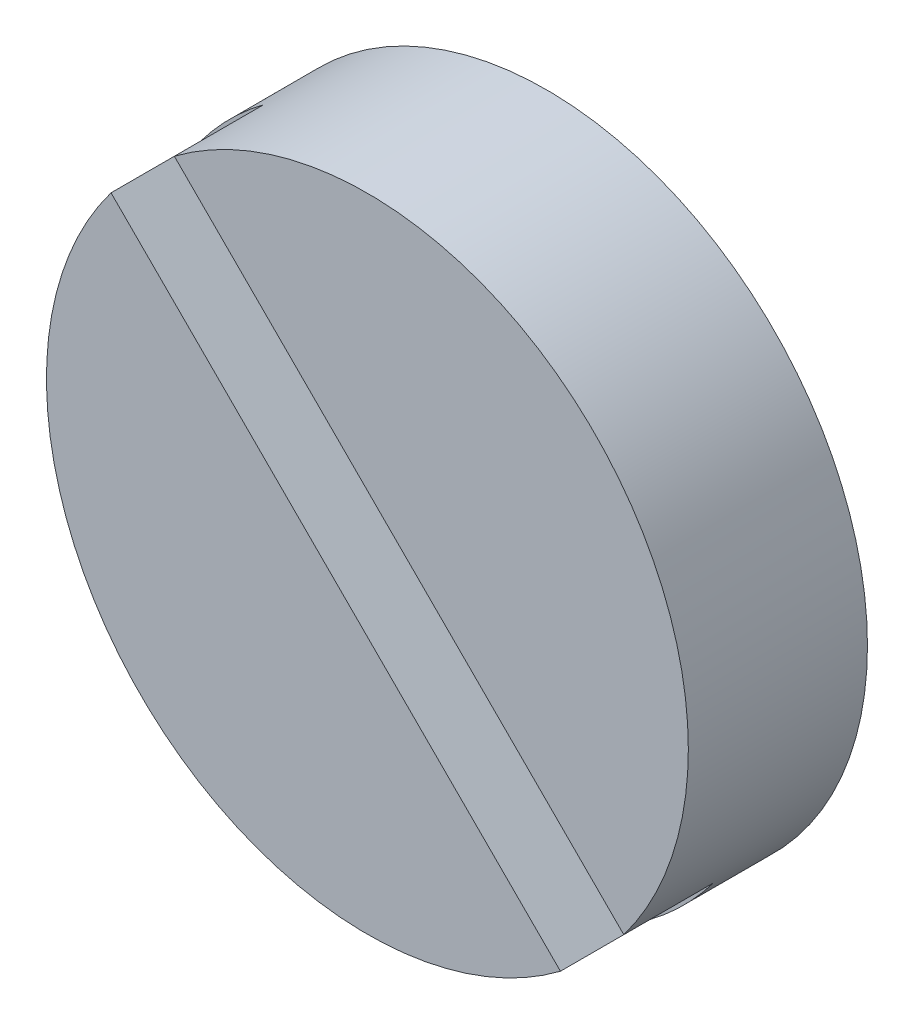
ISO-10303-21;
HEADER;
FILE_DESCRIPTION(('STEP AP214'),'2;1');
FILE_NAME('part.step','',(''),(''),'','','');
FILE_SCHEMA(('AUTOMOTIVE_DESIGN { 1 0 10303 214 1 1 1 1 }'));
ENDSEC;
DATA;
#1=APPLICATION_CONTEXT('core data for automotive mechanical design processes');
#2=APPLICATION_PROTOCOL_DEFINITION('international standard','automotive_design',2000,#1);
#3=PRODUCT_CONTEXT('',#1,'mechanical');
#4=PRODUCT('Part','Part','',(#3));
#5=PRODUCT_RELATED_PRODUCT_CATEGORY('part','',(#4));
#6=PRODUCT_DEFINITION_FORMATION('','',#4);
#7=PRODUCT_DEFINITION_CONTEXT('part definition',#1,'design');
#8=PRODUCT_DEFINITION('design','',#6,#7);
#9=PRODUCT_DEFINITION_SHAPE('','',#8);
#10=(LENGTH_UNIT() NAMED_UNIT(*) SI_UNIT(.MILLI.,.METRE.));
#11=(NAMED_UNIT(*) PLANE_ANGLE_UNIT() SI_UNIT($,.RADIAN.));
#12=(NAMED_UNIT(*) SI_UNIT($,.STERADIAN.) SOLID_ANGLE_UNIT());
#13=UNCERTAINTY_MEASURE_WITH_UNIT(LENGTH_MEASURE(1.E-05),#10,'distance_accuracy_value','');
#14=(GEOMETRIC_REPRESENTATION_CONTEXT(3) GLOBAL_UNCERTAINTY_ASSIGNED_CONTEXT((#13)) GLOBAL_UNIT_ASSIGNED_CONTEXT((#10,
#11,#12)) REPRESENTATION_CONTEXT('',''));
#15=CARTESIAN_POINT('',(0.,0.,0.));
#16=DIRECTION('',(0.,0.,1.));
#17=DIRECTION('',(1.,0.,0.));
#18=AXIS2_PLACEMENT_3D('',#15,#16,#17);
#19=CARTESIAN_POINT('',(49.7387324650882,12.2064521676477,49.3014));
#20=DIRECTION('',(0.70710678118654,0.707106781186555,0.));
#21=DIRECTION('',(0.,0.,-1.));
#22=AXIS2_PLACEMENT_3D('',#19,#20,#21);
#23=PLANE('',#22);
#24=DIRECTION('',(0.,0.,1.));
#25=VECTOR('',#24,1.);
#26=CARTESIAN_POINT('',(45.5326255257677,16.4125591069681,48.8442));
#27=LINE('',#26,#25);
#28=CARTESIAN_POINT('',(45.5326255257677,16.4125591069681,48.4632));
#29=VERTEX_POINT('',#28);
#30=CARTESIAN_POINT('',(45.5326255257677,16.4125591069681,49.2252));
#31=VERTEX_POINT('',#30);
#32=EDGE_CURVE('E78',#29,#31,#27,.T.);
#33=ORIENTED_EDGE('',*,*,#32,.T.);
#34=DIRECTION('',(-0.707106781186545,0.70710678118655,0.));
#35=VECTOR('',#34,1.);
#36=CARTESIAN_POINT('',(47.4444923163679,14.5006923163679,49.2252));
#37=LINE('',#36,#35);
#38=CARTESIAN_POINT('',(49.3563591069681,12.5888255257677,49.2252));
#39=VERTEX_POINT('',#38);
#40=EDGE_CURVE('E80',#39,#31,#37,.T.);
#41=ORIENTED_EDGE('',*,*,#40,.F.);
#42=DIRECTION('',(0.,0.,-1.));
#43=VECTOR('',#42,1.);
#44=CARTESIAN_POINT('',(49.3563591069681,12.5888255257678,48.8442));
#45=LINE('',#44,#43);
#46=CARTESIAN_POINT('',(49.3563591069681,12.5888255257678,48.4632));
#47=VERTEX_POINT('',#46);
#48=EDGE_CURVE('E81',#39,#47,#45,.T.);
#49=ORIENTED_EDGE('',*,*,#48,.T.);
#50=DIRECTION('',(0.707106781186545,-0.70710678118655,0.));
#51=VECTOR('',#50,1.);
#52=CARTESIAN_POINT('',(47.4444923163679,14.5006923163679,48.4632));
#53=LINE('',#52,#51);
#54=EDGE_CURVE('E65',#29,#47,#53,.T.);
#55=ORIENTED_EDGE('',*,*,#54,.F.);
#56=EDGE_LOOP('',(#33,#41,#49,#55));
#57=FACE_BOUND('',#56,.T.);
#58=ADVANCED_FACE('F16',(#57),#23,.T.);
#59=CARTESIAN_POINT('',(41.9247355157471,14.2267874624914,49.2252));
#60=DIRECTION('',(0.,0.,1.));
#61=DIRECTION('',(0.707106781186543,-0.707106781186552,0.));
#62=AXIS2_PLACEMENT_3D('',#59,#60,#61);
#63=PLANE('',#62);
#64=ORIENTED_EDGE('',*,*,#40,.T.);
#65=CARTESIAN_POINT('',(47.7139,14.7701,49.2252));
#66=DIRECTION('',(0.,0.,1.));
#67=DIRECTION('',(1.,0.,0.));
#68=AXIS2_PLACEMENT_3D('',#65,#66,#67);
#69=CIRCLE('',#68,2.73049999999994);
#70=EDGE_CURVE('E66',#39,#31,#69,.F.);
#71=ORIENTED_EDGE('',*,*,#70,.F.);
#72=EDGE_LOOP('',(#64,#71));
#73=FACE_BOUND('',#72,.T.);
#74=ADVANCED_FACE('F90',(#73),#63,.T.);
#75=CARTESIAN_POINT('',(52.9489587381575,14.7701,48.4632));
#76=DIRECTION('',(0.,0.,1.));
#77=DIRECTION('',(-0.707106781186546,0.707106781186549,0.));
#78=AXIS2_PLACEMENT_3D('',#75,#76,#77);
#79=PLANE('',#78);
#80=ORIENTED_EDGE('',*,*,#54,.T.);
#81=CARTESIAN_POINT('',(47.7139,14.7701,48.4632));
#82=DIRECTION('',(0.,0.,1.));
#83=DIRECTION('',(1.,0.,0.));
#84=AXIS2_PLACEMENT_3D('',#81,#82,#83);
#85=CIRCLE('',#84,2.73049999999994);
#86=CARTESIAN_POINT('',(49.8951744742322,13.1276408930318,48.4632));
#87=VERTEX_POINT('',#86);
#88=EDGE_CURVE('E20',#87,#47,#85,.F.);
#89=ORIENTED_EDGE('',*,*,#88,.F.);
#90=DIRECTION('',(0.707106781186536,-0.707106781186559,0.));
#91=VECTOR('',#90,1.);
#92=CARTESIAN_POINT('',(47.983307683632,15.0395076836321,48.4632));
#93=LINE('',#92,#91);
#94=CARTESIAN_POINT('',(46.0714408930318,16.9513744742323,48.4632));
#95=VERTEX_POINT('',#94);
#96=EDGE_CURVE('E62',#95,#87,#93,.T.);
#97=ORIENTED_EDGE('',*,*,#96,.F.);
#98=CARTESIAN_POINT('',(47.7139,14.7701,48.4632));
#99=DIRECTION('',(0.,0.,1.));
#100=DIRECTION('',(1.,0.,0.));
#101=AXIS2_PLACEMENT_3D('',#98,#99,#100);
#102=CIRCLE('',#101,2.73049999999994);
#103=EDGE_CURVE('E55',#29,#95,#102,.F.);
#104=ORIENTED_EDGE('',*,*,#103,.F.);
#105=EDGE_LOOP('',(#80,#89,#97,#104));
#106=FACE_BOUND('',#105,.T.);
#107=ADVANCED_FACE('F61',(#106),#79,.T.);
#108=CARTESIAN_POINT('',(50.2775478323522,12.7452675349118,48.387));
#109=DIRECTION('',(-0.707106781186559,-0.707106781186536,0.));
#110=DIRECTION('',(0.,0.,1.));
#111=AXIS2_PLACEMENT_3D('',#108,#109,#110);
#112=PLANE('',#111);
#113=DIRECTION('',(0.,0.,-1.));
#114=VECTOR('',#113,1.);
#115=CARTESIAN_POINT('',(46.0714408930318,16.9513744742324,48.8442));
#116=LINE('',#115,#114);
#117=CARTESIAN_POINT('',(46.0714408930318,16.9513744742323,49.2252));
#118=VERTEX_POINT('',#117);
#119=EDGE_CURVE('E70',#118,#95,#116,.T.);
#120=ORIENTED_EDGE('',*,*,#119,.T.);
#121=ORIENTED_EDGE('',*,*,#96,.T.);
#122=DIRECTION('',(0.,0.,1.));
#123=VECTOR('',#122,1.);
#124=CARTESIAN_POINT('',(49.8951744742322,13.1276408930318,48.8442));
#125=LINE('',#124,#123);
#126=CARTESIAN_POINT('',(49.8951744742322,13.1276408930318,49.2252));
#127=VERTEX_POINT('',#126);
#128=EDGE_CURVE('E35',#87,#127,#125,.T.);
#129=ORIENTED_EDGE('',*,*,#128,.T.);
#130=DIRECTION('',(0.707106781186543,-0.707106781186552,0.));
#131=VECTOR('',#130,1.);
#132=CARTESIAN_POINT('',(47.983307683632,15.039507683632,49.2252));
#133=LINE('',#132,#131);
#134=EDGE_CURVE('E73',#118,#127,#133,.T.);
#135=ORIENTED_EDGE('',*,*,#134,.F.);
#136=EDGE_LOOP('',(#120,#121,#129,#135));
#137=FACE_BOUND('',#136,.T.);
#138=ADVANCED_FACE('F72',(#137),#112,.T.);
#139=CARTESIAN_POINT('',(47.7139,8.25810514612762,47.7012));
#140=DIRECTION('',(0.,0.,-1.));
#141=DIRECTION('',(-0.707106781186552,0.707106781186543,0.));
#142=AXIS2_PLACEMENT_3D('',#139,#140,#141);
#143=PLANE('',#142);
#144=CARTESIAN_POINT('',(47.7139,14.7701,47.7012));
#145=DIRECTION('',(0.,0.,1.));
#146=DIRECTION('',(1.,0.,0.));
#147=AXIS2_PLACEMENT_3D('',#144,#145,#146);
#148=CIRCLE('',#147,2.73049999999994);
#149=CARTESIAN_POINT('',(50.4443999999999,14.7701,47.7012));
#150=VERTEX_POINT('',#149);
#151=EDGE_CURVE('E26',#150,#150,#148,.T.);
#152=ORIENTED_EDGE('',*,*,#151,.F.);
#153=EDGE_LOOP('',(#152));
#154=FACE_BOUND('',#153,.T.);
#155=ADVANCED_FACE('F106',(#154),#143,.T.);
#156=CARTESIAN_POINT('',(43.0113605907644,15.3134125375087,49.2252));
#157=DIRECTION('',(0.,0.,1.));
#158=DIRECTION('',(0.707106781186542,-0.707106781186553,0.));
#159=AXIS2_PLACEMENT_3D('',#156,#157,#158);
#160=PLANE('',#159);
#161=ORIENTED_EDGE('',*,*,#134,.T.);
#162=CARTESIAN_POINT('',(47.7139,14.7701,49.2252));
#163=DIRECTION('',(0.,0.,1.));
#164=DIRECTION('',(1.,0.,0.));
#165=AXIS2_PLACEMENT_3D('',#162,#163,#164);
#166=CIRCLE('',#165,2.73049999999994);
#167=EDGE_CURVE('E10',#118,#127,#166,.F.);
#168=ORIENTED_EDGE('',*,*,#167,.F.);
#169=EDGE_LOOP('',(#161,#168));
#170=FACE_BOUND('',#169,.T.);
#171=ADVANCED_FACE('F18',(#170),#160,.T.);
#172=CARTESIAN_POINT('',(47.7139,14.7701,49.2252));
#173=DIRECTION('',(0.,0.,1.));
#174=DIRECTION('',(1.,0.,0.));
#175=AXIS2_PLACEMENT_3D('',#172,#173,#174);
#176=CYLINDRICAL_SURFACE('',#175,2.73049999999994);
#177=ORIENTED_EDGE('',*,*,#128,.F.);
#178=ORIENTED_EDGE('',*,*,#88,.T.);
#179=ORIENTED_EDGE('',*,*,#48,.F.);
#180=ORIENTED_EDGE('',*,*,#70,.T.);
#181=ORIENTED_EDGE('',*,*,#32,.F.);
#182=ORIENTED_EDGE('',*,*,#103,.T.);
#183=ORIENTED_EDGE('',*,*,#119,.F.);
#184=ORIENTED_EDGE('',*,*,#167,.T.);
#185=EDGE_LOOP('',(#177,#178,#179,#180,#181,#182,#183,#184));
#186=FACE_BOUND('',#185,.T.);
#187=ORIENTED_EDGE('',*,*,#151,.T.);
#188=EDGE_LOOP('',(#187));
#189=FACE_BOUND('',#188,.T.);
#190=ADVANCED_FACE('F67',(#186,#189),#176,.T.);
#191=CLOSED_SHELL('',(#58,#74,#107,#138,#155,#171,#190));
#192=MANIFOLD_SOLID_BREP('B1',#191);
#193=ADVANCED_BREP_SHAPE_REPRESENTATION('',(#18,#192),#14);
#194=SHAPE_DEFINITION_REPRESENTATION(#9,#193);
ENDSEC;
END-ISO-10303-21;
